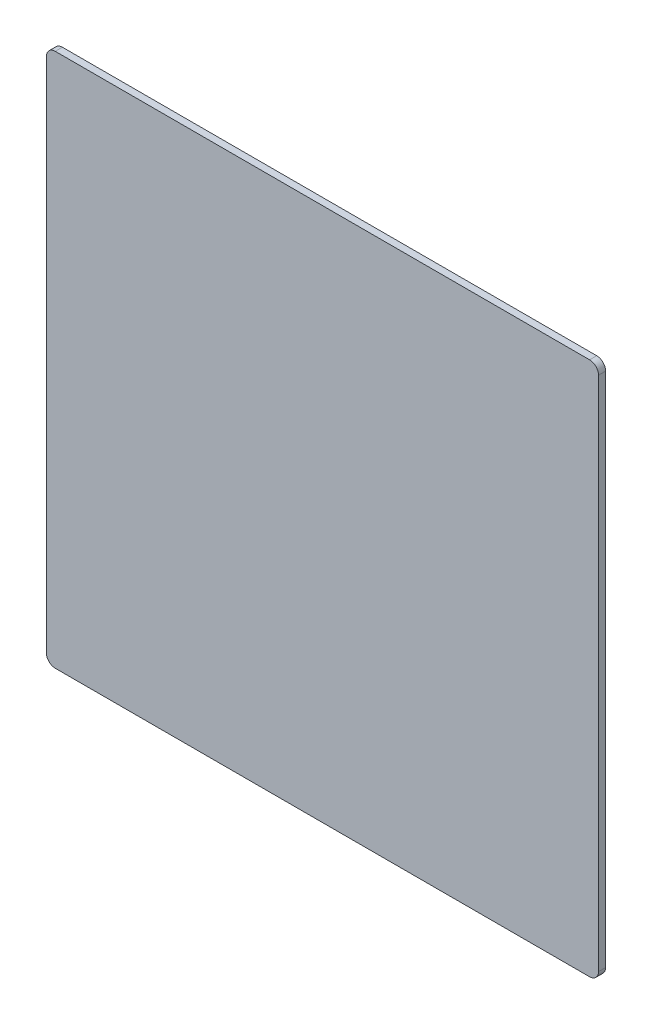
ISO-10303-21;
HEADER;
FILE_DESCRIPTION(('STEP AP214'),'2;1');
FILE_NAME('part.step','',(''),(''),'','','');
FILE_SCHEMA(('AUTOMOTIVE_DESIGN { 1 0 10303 214 1 1 1 1 }'));
ENDSEC;
DATA;
#1=APPLICATION_CONTEXT('core data for automotive mechanical design processes');
#2=APPLICATION_PROTOCOL_DEFINITION('international standard','automotive_design',2000,#1);
#3=PRODUCT_CONTEXT('',#1,'mechanical');
#4=PRODUCT('Part','Part','',(#3));
#5=PRODUCT_RELATED_PRODUCT_CATEGORY('part','',(#4));
#6=PRODUCT_DEFINITION_FORMATION('','',#4);
#7=PRODUCT_DEFINITION_CONTEXT('part definition',#1,'design');
#8=PRODUCT_DEFINITION('design','',#6,#7);
#9=PRODUCT_DEFINITION_SHAPE('','',#8);
#10=(LENGTH_UNIT() NAMED_UNIT(*) SI_UNIT(.MILLI.,.METRE.));
#11=(NAMED_UNIT(*) PLANE_ANGLE_UNIT() SI_UNIT($,.RADIAN.));
#12=(NAMED_UNIT(*) SI_UNIT($,.STERADIAN.) SOLID_ANGLE_UNIT());
#13=UNCERTAINTY_MEASURE_WITH_UNIT(LENGTH_MEASURE(1.E-05),#10,'distance_accuracy_value','');
#14=(GEOMETRIC_REPRESENTATION_CONTEXT(3) GLOBAL_UNCERTAINTY_ASSIGNED_CONTEXT((#13)) GLOBAL_UNIT_ASSIGNED_CONTEXT((#10,
#11,#12)) REPRESENTATION_CONTEXT('',''));
#15=CARTESIAN_POINT('',(0.,0.,0.));
#16=DIRECTION('',(0.,0.,1.));
#17=DIRECTION('',(1.,0.,0.));
#18=AXIS2_PLACEMENT_3D('',#15,#16,#17);
#19=CARTESIAN_POINT('',(155.,-150.,4.));
#20=DIRECTION('',(-1.,0.,0.));
#21=DIRECTION('',(0.,0.,1.));
#22=AXIS2_PLACEMENT_3D('',#19,#20,#21);
#23=PLANE('',#22);
#24=DIRECTION('',(0.,1.,0.));
#25=VECTOR('',#24,1.);
#26=CARTESIAN_POINT('',(155.,-150.,4.));
#27=LINE('',#26,#25);
#28=CARTESIAN_POINT('',(155.,-145.,4.));
#29=VERTEX_POINT('',#28);
#30=CARTESIAN_POINT('',(155.,145.,4.));
#31=VERTEX_POINT('',#30);
#32=EDGE_CURVE('E136',#29,#31,#27,.T.);
#33=ORIENTED_EDGE('',*,*,#32,.F.);
#34=DIRECTION('',(0.,0.,-1.));
#35=VECTOR('',#34,1.);
#36=CARTESIAN_POINT('',(155.,-145.,4.));
#37=LINE('',#36,#35);
#38=CARTESIAN_POINT('',(155.,-145.,0.));
#39=VERTEX_POINT('',#38);
#40=EDGE_CURVE('E120',#29,#39,#37,.T.);
#41=ORIENTED_EDGE('',*,*,#40,.T.);
#42=DIRECTION('',(0.,1.,0.));
#43=VECTOR('',#42,1.);
#44=CARTESIAN_POINT('',(155.,-150.,0.));
#45=LINE('',#44,#43);
#46=CARTESIAN_POINT('',(155.,145.,0.));
#47=VERTEX_POINT('',#46);
#48=EDGE_CURVE('E133',#39,#47,#45,.T.);
#49=ORIENTED_EDGE('',*,*,#48,.T.);
#50=DIRECTION('',(0.,0.,-1.));
#51=VECTOR('',#50,1.);
#52=CARTESIAN_POINT('',(155.,145.,4.));
#53=LINE('',#52,#51);
#54=EDGE_CURVE('E139',#47,#31,#53,.F.);
#55=ORIENTED_EDGE('',*,*,#54,.T.);
#56=EDGE_LOOP('',(#33,#41,#49,#55));
#57=FACE_BOUND('',#56,.T.);
#58=ADVANCED_FACE('F49',(#57),#23,.F.);
#59=CARTESIAN_POINT('',(-155.,150.,4.));
#60=DIRECTION('',(0.,-1.,0.));
#61=DIRECTION('',(0.,0.,-1.));
#62=AXIS2_PLACEMENT_3D('',#59,#60,#61);
#63=PLANE('',#62);
#64=DIRECTION('',(-1.,0.,0.));
#65=VECTOR('',#64,1.);
#66=CARTESIAN_POINT('',(-155.,150.,4.));
#67=LINE('',#66,#65);
#68=CARTESIAN_POINT('',(150.,150.,4.));
#69=VERTEX_POINT('',#68);
#70=CARTESIAN_POINT('',(-150.,150.,4.));
#71=VERTEX_POINT('',#70);
#72=EDGE_CURVE('E195',#69,#71,#67,.T.);
#73=ORIENTED_EDGE('',*,*,#72,.F.);
#74=DIRECTION('',(0.,0.,-1.));
#75=VECTOR('',#74,1.);
#76=CARTESIAN_POINT('',(150.,150.,4.));
#77=LINE('',#76,#75);
#78=CARTESIAN_POINT('',(150.,150.,0.));
#79=VERTEX_POINT('',#78);
#80=EDGE_CURVE('E187',#69,#79,#77,.T.);
#81=ORIENTED_EDGE('',*,*,#80,.T.);
#82=DIRECTION('',(-1.,0.,0.));
#83=VECTOR('',#82,1.);
#84=CARTESIAN_POINT('',(-155.,150.,0.));
#85=LINE('',#84,#83);
#86=CARTESIAN_POINT('',(-150.,150.,0.));
#87=VERTEX_POINT('',#86);
#88=EDGE_CURVE('E144',#79,#87,#85,.T.);
#89=ORIENTED_EDGE('',*,*,#88,.T.);
#90=DIRECTION('',(0.,0.,-1.));
#91=VECTOR('',#90,1.);
#92=CARTESIAN_POINT('',(-150.,150.,4.));
#93=LINE('',#92,#91);
#94=EDGE_CURVE('E184',#87,#71,#93,.F.);
#95=ORIENTED_EDGE('',*,*,#94,.T.);
#96=EDGE_LOOP('',(#73,#81,#89,#95));
#97=FACE_BOUND('',#96,.T.);
#98=ADVANCED_FACE('F215',(#97),#63,.F.);
#99=CARTESIAN_POINT('',(-155.,-150.,4.));
#100=DIRECTION('',(1.,0.,0.));
#101=DIRECTION('',(0.,0.,-1.));
#102=AXIS2_PLACEMENT_3D('',#99,#100,#101);
#103=PLANE('',#102);
#104=DIRECTION('',(0.,-1.,0.));
#105=VECTOR('',#104,1.);
#106=CARTESIAN_POINT('',(-155.,-150.,4.));
#107=LINE('',#106,#105);
#108=CARTESIAN_POINT('',(-155.,145.,4.));
#109=VERTEX_POINT('',#108);
#110=CARTESIAN_POINT('',(-155.,-145.,4.));
#111=VERTEX_POINT('',#110);
#112=EDGE_CURVE('E193',#109,#111,#107,.T.);
#113=ORIENTED_EDGE('',*,*,#112,.F.);
#114=DIRECTION('',(0.,0.,-1.));
#115=VECTOR('',#114,1.);
#116=CARTESIAN_POINT('',(-155.,145.,4.));
#117=LINE('',#116,#115);
#118=CARTESIAN_POINT('',(-155.,145.,0.));
#119=VERTEX_POINT('',#118);
#120=EDGE_CURVE('E11',#109,#119,#117,.T.);
#121=ORIENTED_EDGE('',*,*,#120,.T.);
#122=DIRECTION('',(0.,-1.,0.));
#123=VECTOR('',#122,1.);
#124=CARTESIAN_POINT('',(-155.,-150.,0.));
#125=LINE('',#124,#123);
#126=CARTESIAN_POINT('',(-155.,-145.,0.));
#127=VERTEX_POINT('',#126);
#128=EDGE_CURVE('E149',#119,#127,#125,.T.);
#129=ORIENTED_EDGE('',*,*,#128,.T.);
#130=DIRECTION('',(0.,0.,-1.));
#131=VECTOR('',#130,1.);
#132=CARTESIAN_POINT('',(-155.,-145.,4.));
#133=LINE('',#132,#131);
#134=EDGE_CURVE('E58',#127,#111,#133,.F.);
#135=ORIENTED_EDGE('',*,*,#134,.T.);
#136=EDGE_LOOP('',(#113,#121,#129,#135));
#137=FACE_BOUND('',#136,.T.);
#138=ADVANCED_FACE('F210',(#137),#103,.F.);
#139=CARTESIAN_POINT('',(-155.,-150.,4.));
#140=DIRECTION('',(0.,1.,0.));
#141=DIRECTION('',(0.,0.,1.));
#142=AXIS2_PLACEMENT_3D('',#139,#140,#141);
#143=PLANE('',#142);
#144=DIRECTION('',(1.,0.,0.));
#145=VECTOR('',#144,1.);
#146=CARTESIAN_POINT('',(-155.,-150.,0.));
#147=LINE('',#146,#145);
#148=CARTESIAN_POINT('',(-150.,-150.,0.));
#149=VERTEX_POINT('',#148);
#150=CARTESIAN_POINT('',(150.,-150.,0.));
#151=VERTEX_POINT('',#150);
#152=EDGE_CURVE('E157',#149,#151,#147,.T.);
#153=ORIENTED_EDGE('',*,*,#152,.T.);
#154=DIRECTION('',(0.,0.,-1.));
#155=VECTOR('',#154,1.);
#156=CARTESIAN_POINT('',(150.,-150.,4.));
#157=LINE('',#156,#155);
#158=CARTESIAN_POINT('',(150.,-150.,4.));
#159=VERTEX_POINT('',#158);
#160=EDGE_CURVE('E121',#151,#159,#157,.F.);
#161=ORIENTED_EDGE('',*,*,#160,.T.);
#162=DIRECTION('',(1.,0.,0.));
#163=VECTOR('',#162,1.);
#164=CARTESIAN_POINT('',(-155.,-150.,4.));
#165=LINE('',#164,#163);
#166=CARTESIAN_POINT('',(-150.,-150.,4.));
#167=VERTEX_POINT('',#166);
#168=EDGE_CURVE('E152',#167,#159,#165,.T.);
#169=ORIENTED_EDGE('',*,*,#168,.F.);
#170=DIRECTION('',(0.,0.,-1.));
#171=VECTOR('',#170,1.);
#172=CARTESIAN_POINT('',(-150.,-150.,4.));
#173=LINE('',#172,#171);
#174=EDGE_CURVE('E127',#167,#149,#173,.T.);
#175=ORIENTED_EDGE('',*,*,#174,.T.);
#176=EDGE_LOOP('',(#153,#161,#169,#175));
#177=FACE_BOUND('',#176,.T.);
#178=ADVANCED_FACE('F208',(#177),#143,.F.);
#179=CARTESIAN_POINT('',(0.,0.,4.));
#180=DIRECTION('',(0.,0.,-1.));
#181=DIRECTION('',(-1.,0.,0.));
#182=AXIS2_PLACEMENT_3D('',#179,#180,#181);
#183=PLANE('',#182);
#184=ORIENTED_EDGE('',*,*,#168,.T.);
#185=CARTESIAN_POINT('',(150.,-145.,4.));
#186=DIRECTION('',(0.,0.,-1.));
#187=DIRECTION('',(-1.,0.,0.));
#188=AXIS2_PLACEMENT_3D('',#185,#186,#187);
#189=CIRCLE('',#188,5.);
#190=EDGE_CURVE('E181',#159,#29,#189,.F.);
#191=ORIENTED_EDGE('',*,*,#190,.T.);
#192=ORIENTED_EDGE('',*,*,#32,.T.);
#193=CARTESIAN_POINT('',(150.,145.,4.));
#194=DIRECTION('',(0.,0.,-1.));
#195=DIRECTION('',(-1.,0.,0.));
#196=AXIS2_PLACEMENT_3D('',#193,#194,#195);
#197=CIRCLE('',#196,5.);
#198=EDGE_CURVE('E178',#31,#69,#197,.F.);
#199=ORIENTED_EDGE('',*,*,#198,.T.);
#200=ORIENTED_EDGE('',*,*,#72,.T.);
#201=CARTESIAN_POINT('',(-150.,145.,4.));
#202=DIRECTION('',(0.,0.,-1.));
#203=DIRECTION('',(-1.,0.,0.));
#204=AXIS2_PLACEMENT_3D('',#201,#202,#203);
#205=CIRCLE('',#204,5.);
#206=EDGE_CURVE('E71',#71,#109,#205,.F.);
#207=ORIENTED_EDGE('',*,*,#206,.T.);
#208=ORIENTED_EDGE('',*,*,#112,.T.);
#209=CARTESIAN_POINT('',(-150.,-145.,4.));
#210=DIRECTION('',(0.,0.,-1.));
#211=DIRECTION('',(-1.,0.,0.));
#212=AXIS2_PLACEMENT_3D('',#209,#210,#211);
#213=CIRCLE('',#212,5.);
#214=EDGE_CURVE('E173',#111,#167,#213,.F.);
#215=ORIENTED_EDGE('',*,*,#214,.T.);
#216=EDGE_LOOP('',(#184,#191,#192,#199,#200,#207,#208,#215));
#217=FACE_BOUND('',#216,.T.);
#218=ADVANCED_FACE('F202',(#217),#183,.F.);
#219=CARTESIAN_POINT('',(0.,0.,0.));
#220=DIRECTION('',(0.,0.,-1.));
#221=DIRECTION('',(-1.,0.,0.));
#222=AXIS2_PLACEMENT_3D('',#219,#220,#221);
#223=PLANE('',#222);
#224=ORIENTED_EDGE('',*,*,#48,.F.);
#225=CARTESIAN_POINT('',(150.,-145.,0.));
#226=DIRECTION('',(0.,0.,-1.));
#227=DIRECTION('',(-1.,0.,0.));
#228=AXIS2_PLACEMENT_3D('',#225,#226,#227);
#229=CIRCLE('',#228,5.);
#230=EDGE_CURVE('E116',#39,#151,#229,.T.);
#231=ORIENTED_EDGE('',*,*,#230,.T.);
#232=ORIENTED_EDGE('',*,*,#152,.F.);
#233=CARTESIAN_POINT('',(-150.,-145.,0.));
#234=DIRECTION('',(0.,0.,-1.));
#235=DIRECTION('',(-1.,0.,0.));
#236=AXIS2_PLACEMENT_3D('',#233,#234,#235);
#237=CIRCLE('',#236,5.);
#238=EDGE_CURVE('E138',#149,#127,#237,.T.);
#239=ORIENTED_EDGE('',*,*,#238,.T.);
#240=ORIENTED_EDGE('',*,*,#128,.F.);
#241=CARTESIAN_POINT('',(-150.,145.,0.));
#242=DIRECTION('',(0.,0.,-1.));
#243=DIRECTION('',(-1.,0.,0.));
#244=AXIS2_PLACEMENT_3D('',#241,#242,#243);
#245=CIRCLE('',#244,5.);
#246=EDGE_CURVE('E164',#119,#87,#245,.T.);
#247=ORIENTED_EDGE('',*,*,#246,.T.);
#248=ORIENTED_EDGE('',*,*,#88,.F.);
#249=CARTESIAN_POINT('',(150.,145.,0.));
#250=DIRECTION('',(0.,0.,-1.));
#251=DIRECTION('',(-1.,0.,0.));
#252=AXIS2_PLACEMENT_3D('',#249,#250,#251);
#253=CIRCLE('',#252,5.);
#254=EDGE_CURVE('E128',#79,#47,#253,.T.);
#255=ORIENTED_EDGE('',*,*,#254,.T.);
#256=EDGE_LOOP('',(#224,#231,#232,#239,#240,#247,#248,#255));
#257=FACE_BOUND('',#256,.T.);
#258=ADVANCED_FACE('F141',(#257),#223,.T.);
#259=CARTESIAN_POINT('',(150.,-145.,4.));
#260=DIRECTION('',(0.,0.,-1.));
#261=DIRECTION('',(-1.,0.,0.));
#262=AXIS2_PLACEMENT_3D('',#259,#260,#261);
#263=CYLINDRICAL_SURFACE('',#262,5.);
#264=ORIENTED_EDGE('',*,*,#190,.F.);
#265=ORIENTED_EDGE('',*,*,#160,.F.);
#266=ORIENTED_EDGE('',*,*,#230,.F.);
#267=ORIENTED_EDGE('',*,*,#40,.F.);
#268=EDGE_LOOP('',(#264,#265,#266,#267));
#269=FACE_BOUND('',#268,.T.);
#270=ADVANCED_FACE('F119',(#269),#263,.T.);
#271=CARTESIAN_POINT('',(150.,145.,4.));
#272=DIRECTION('',(0.,0.,-1.));
#273=DIRECTION('',(-1.,0.,0.));
#274=AXIS2_PLACEMENT_3D('',#271,#272,#273);
#275=CYLINDRICAL_SURFACE('',#274,5.);
#276=ORIENTED_EDGE('',*,*,#198,.F.);
#277=ORIENTED_EDGE('',*,*,#54,.F.);
#278=ORIENTED_EDGE('',*,*,#254,.F.);
#279=ORIENTED_EDGE('',*,*,#80,.F.);
#280=EDGE_LOOP('',(#276,#277,#278,#279));
#281=FACE_BOUND('',#280,.T.);
#282=ADVANCED_FACE('F219',(#281),#275,.T.);
#283=CARTESIAN_POINT('',(-150.,145.,4.));
#284=DIRECTION('',(0.,0.,-1.));
#285=DIRECTION('',(-1.,0.,0.));
#286=AXIS2_PLACEMENT_3D('',#283,#284,#285);
#287=CYLINDRICAL_SURFACE('',#286,5.);
#288=ORIENTED_EDGE('',*,*,#206,.F.);
#289=ORIENTED_EDGE('',*,*,#94,.F.);
#290=ORIENTED_EDGE('',*,*,#246,.F.);
#291=ORIENTED_EDGE('',*,*,#120,.F.);
#292=EDGE_LOOP('',(#288,#289,#290,#291));
#293=FACE_BOUND('',#292,.T.);
#294=ADVANCED_FACE('F212',(#293),#287,.T.);
#295=CARTESIAN_POINT('',(-150.,-145.,4.));
#296=DIRECTION('',(0.,0.,-1.));
#297=DIRECTION('',(-1.,0.,0.));
#298=AXIS2_PLACEMENT_3D('',#295,#296,#297);
#299=CYLINDRICAL_SURFACE('',#298,5.);
#300=ORIENTED_EDGE('',*,*,#214,.F.);
#301=ORIENTED_EDGE('',*,*,#134,.F.);
#302=ORIENTED_EDGE('',*,*,#238,.F.);
#303=ORIENTED_EDGE('',*,*,#174,.F.);
#304=EDGE_LOOP('',(#300,#301,#302,#303));
#305=FACE_BOUND('',#304,.T.);
#306=ADVANCED_FACE('F51',(#305),#299,.T.);
#307=CLOSED_SHELL('',(#58,#98,#138,#178,#218,#258,#270,#282,#294,#306));
#308=MANIFOLD_SOLID_BREP('B2',#307);
#309=ADVANCED_BREP_SHAPE_REPRESENTATION('',(#18,#308),#14);
#310=SHAPE_DEFINITION_REPRESENTATION(#9,#309);
ENDSEC;
END-ISO-10303-21;
